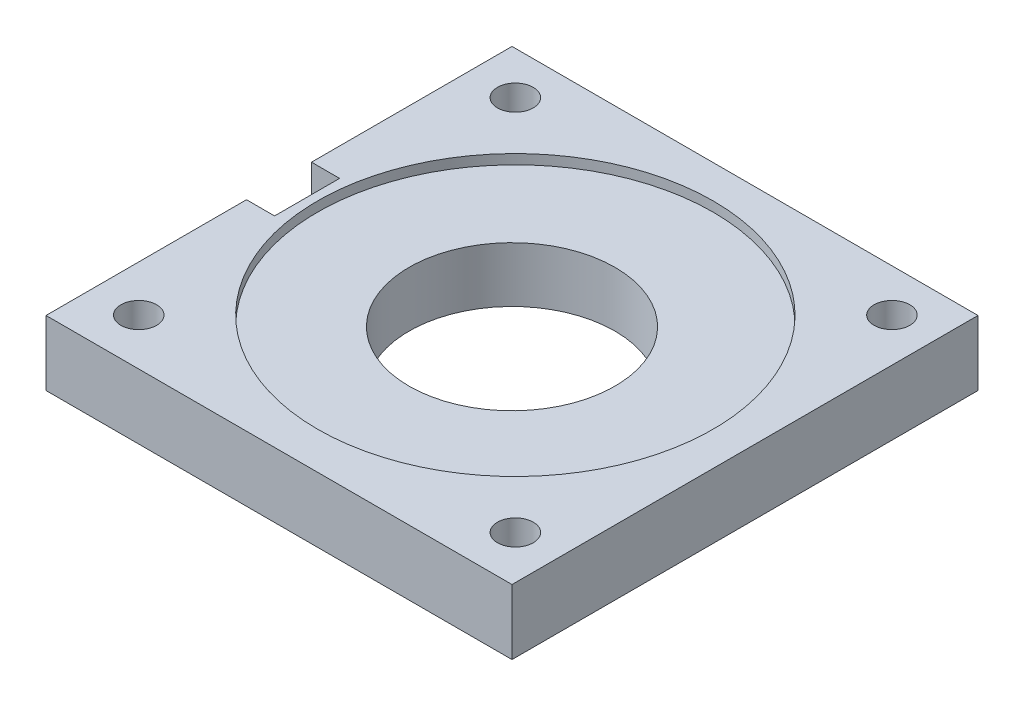
ISO-10303-21;
HEADER;
FILE_DESCRIPTION(('STEP AP214'),'2;1');
FILE_NAME('part.step','',(''),(''),'','','');
FILE_SCHEMA(('AUTOMOTIVE_DESIGN { 1 0 10303 214 1 1 1 1 }'));
ENDSEC;
DATA;
#1=APPLICATION_CONTEXT('core data for automotive mechanical design processes');
#2=APPLICATION_PROTOCOL_DEFINITION('international standard','automotive_design',2000,#1);
#3=PRODUCT_CONTEXT('',#1,'mechanical');
#4=PRODUCT('Part','Part','',(#3));
#5=PRODUCT_RELATED_PRODUCT_CATEGORY('part','',(#4));
#6=PRODUCT_DEFINITION_FORMATION('','',#4);
#7=PRODUCT_DEFINITION_CONTEXT('part definition',#1,'design');
#8=PRODUCT_DEFINITION('design','',#6,#7);
#9=PRODUCT_DEFINITION_SHAPE('','',#8);
#10=(LENGTH_UNIT() NAMED_UNIT(*) SI_UNIT(.MILLI.,.METRE.));
#11=(NAMED_UNIT(*) PLANE_ANGLE_UNIT() SI_UNIT($,.RADIAN.));
#12=(NAMED_UNIT(*) SI_UNIT($,.STERADIAN.) SOLID_ANGLE_UNIT());
#13=UNCERTAINTY_MEASURE_WITH_UNIT(LENGTH_MEASURE(1.E-05),#10,'distance_accuracy_value','');
#14=(GEOMETRIC_REPRESENTATION_CONTEXT(3) GLOBAL_UNCERTAINTY_ASSIGNED_CONTEXT((#13)) GLOBAL_UNIT_ASSIGNED_CONTEXT((#10,
#11,#12)) REPRESENTATION_CONTEXT('',''));
#15=CARTESIAN_POINT('',(0.,0.,0.));
#16=DIRECTION('',(0.,0.,1.));
#17=DIRECTION('',(1.,0.,0.));
#18=AXIS2_PLACEMENT_3D('',#15,#16,#17);
#19=CARTESIAN_POINT('',(-43.,12.,-43.));
#20=DIRECTION('',(1.,0.,0.));
#21=DIRECTION('',(0.,0.,-1.));
#22=AXIS2_PLACEMENT_3D('',#19,#20,#21);
#23=PLANE('',#22);
#24=DIRECTION('',(0.,0.,1.));
#25=VECTOR('',#24,1.);
#26=CARTESIAN_POINT('',(-43.,12.,-43.));
#27=LINE('',#26,#25);
#28=CARTESIAN_POINT('',(-43.,12.,6.00000000000001));
#29=VERTEX_POINT('',#28);
#30=CARTESIAN_POINT('',(-43.,12.,43.));
#31=VERTEX_POINT('',#30);
#32=EDGE_CURVE('E180',#29,#31,#27,.T.);
#33=ORIENTED_EDGE('',*,*,#32,.F.);
#34=DIRECTION('',(0.,-1.,0.));
#35=VECTOR('',#34,1.);
#36=CARTESIAN_POINT('',(-43.,12.,6.00000000000001));
#37=LINE('',#36,#35);
#38=CARTESIAN_POINT('',(-43.,0.,6.00000000000001));
#39=VERTEX_POINT('',#38);
#40=EDGE_CURVE('E11',#29,#39,#37,.T.);
#41=ORIENTED_EDGE('',*,*,#40,.T.);
#42=DIRECTION('',(0.,0.,1.));
#43=VECTOR('',#42,1.);
#44=CARTESIAN_POINT('',(-43.,0.,-43.));
#45=LINE('',#44,#43);
#46=CARTESIAN_POINT('',(-43.,0.,43.));
#47=VERTEX_POINT('',#46);
#48=EDGE_CURVE('E190',#39,#47,#45,.T.);
#49=ORIENTED_EDGE('',*,*,#48,.T.);
#50=DIRECTION('',(0.,-1.,0.));
#51=VECTOR('',#50,1.);
#52=CARTESIAN_POINT('',(-43.,12.,43.));
#53=LINE('',#52,#51);
#54=EDGE_CURVE('E195',#31,#47,#53,.T.);
#55=ORIENTED_EDGE('',*,*,#54,.F.);
#56=EDGE_LOOP('',(#33,#41,#49,#55));
#57=FACE_BOUND('',#56,.T.);
#58=ADVANCED_FACE('F37',(#57),#23,.F.);
#59=CARTESIAN_POINT('',(0.,12.,0.));
#60=DIRECTION('',(0.,-1.,0.));
#61=DIRECTION('',(0.,0.,-1.));
#62=AXIS2_PLACEMENT_3D('',#59,#60,#61);
#63=CYLINDRICAL_SURFACE('',#62,19.);
#64=CARTESIAN_POINT('',(0.,0.,0.));
#65=DIRECTION('',(0.,1.,0.));
#66=DIRECTION('',(0.,0.,1.));
#67=AXIS2_PLACEMENT_3D('',#64,#65,#66);
#68=CIRCLE('',#67,19.);
#69=CARTESIAN_POINT('',(0.,0.,19.));
#70=VERTEX_POINT('',#69);
#71=EDGE_CURVE('E173',#70,#70,#68,.T.);
#72=ORIENTED_EDGE('',*,*,#71,.F.);
#73=EDGE_LOOP('',(#72));
#74=FACE_BOUND('',#73,.T.);
#75=CARTESIAN_POINT('',(0.,10.2,0.));
#76=DIRECTION('',(0.,1.,0.));
#77=DIRECTION('',(0.,0.,1.));
#78=AXIS2_PLACEMENT_3D('',#75,#76,#77);
#79=CIRCLE('',#78,19.);
#80=CARTESIAN_POINT('',(0.,10.2,19.));
#81=VERTEX_POINT('',#80);
#82=EDGE_CURVE('E146',#81,#81,#79,.T.);
#83=ORIENTED_EDGE('',*,*,#82,.T.);
#84=EDGE_LOOP('',(#83));
#85=FACE_BOUND('',#84,.T.);
#86=ADVANCED_FACE('F232',(#74,#85),#63,.F.);
#87=CARTESIAN_POINT('',(0.,12.,0.));
#88=DIRECTION('',(0.,1.,0.));
#89=DIRECTION('',(0.,0.,1.));
#90=AXIS2_PLACEMENT_3D('',#87,#88,#89);
#91=PLANE('',#90);
#92=DIRECTION('',(1.,0.,0.));
#93=VECTOR('',#92,1.);
#94=CARTESIAN_POINT('',(-45.8870260509217,12.,6.00000000000001));
#95=LINE('',#94,#93);
#96=CARTESIAN_POINT('',(-37.816413021325,12.,6.00000000000001));
#97=VERTEX_POINT('',#96);
#98=EDGE_CURVE('E134',#29,#97,#95,.T.);
#99=ORIENTED_EDGE('',*,*,#98,.F.);
#100=ORIENTED_EDGE('',*,*,#32,.T.);
#101=DIRECTION('',(1.,0.,0.));
#102=VECTOR('',#101,1.);
#103=CARTESIAN_POINT('',(-43.,12.,43.));
#104=LINE('',#103,#102);
#105=CARTESIAN_POINT('',(43.,12.,43.));
#106=VERTEX_POINT('',#105);
#107=EDGE_CURVE('E61',#31,#106,#104,.T.);
#108=ORIENTED_EDGE('',*,*,#107,.T.);
#109=DIRECTION('',(0.,0.,-1.));
#110=VECTOR('',#109,1.);
#111=CARTESIAN_POINT('',(43.,12.,-43.));
#112=LINE('',#111,#110);
#113=CARTESIAN_POINT('',(43.,12.,-43.));
#114=VERTEX_POINT('',#113);
#115=EDGE_CURVE('E177',#106,#114,#112,.T.);
#116=ORIENTED_EDGE('',*,*,#115,.T.);
#117=DIRECTION('',(-1.,0.,0.));
#118=VECTOR('',#117,1.);
#119=CARTESIAN_POINT('',(-43.,12.,-43.));
#120=LINE('',#119,#118);
#121=CARTESIAN_POINT('',(-43.,12.,-43.));
#122=VERTEX_POINT('',#121);
#123=EDGE_CURVE('E90',#114,#122,#120,.T.);
#124=ORIENTED_EDGE('',*,*,#123,.T.);
#125=CARTESIAN_POINT('',(-43.,12.,-5.99999999999998));
#126=VERTEX_POINT('',#125);
#127=EDGE_CURVE('E181',#122,#126,#27,.T.);
#128=ORIENTED_EDGE('',*,*,#127,.T.);
#129=DIRECTION('',(-1.,0.,0.));
#130=VECTOR('',#129,1.);
#131=CARTESIAN_POINT('',(-45.8870260509217,12.,-5.99999999999999));
#132=LINE('',#131,#130);
#133=CARTESIAN_POINT('',(-37.816413021325,12.,-5.99999999999999));
#134=VERTEX_POINT('',#133);
#135=EDGE_CURVE('E52',#134,#126,#132,.T.);
#136=ORIENTED_EDGE('',*,*,#135,.F.);
#137=DIRECTION('',(0.,0.,-1.));
#138=VECTOR('',#137,1.);
#139=CARTESIAN_POINT('',(-37.816413021325,12.,-5.99999999999999));
#140=LINE('',#139,#138);
#141=EDGE_CURVE('E120',#97,#134,#140,.T.);
#142=ORIENTED_EDGE('',*,*,#141,.F.);
#143=EDGE_LOOP('',(#99,#100,#108,#116,#124,#128,#136,#142));
#144=FACE_BOUND('',#143,.T.);
#145=CARTESIAN_POINT('',(0.242410087433292,12.,-0.376719542038495));
#146=DIRECTION('',(0.,1.,0.));
#147=DIRECTION('',(0.,0.,1.));
#148=AXIS2_PLACEMENT_3D('',#145,#146,#147);
#149=CIRCLE('',#148,36.5);
#150=CARTESIAN_POINT('',(0.242410087433292,12.,36.1232804579615));
#151=VERTEX_POINT('',#150);
#152=EDGE_CURVE('E141',#151,#151,#149,.T.);
#153=ORIENTED_EDGE('',*,*,#152,.F.);
#154=EDGE_LOOP('',(#153));
#155=FACE_BOUND('',#154,.T.);
#156=CARTESIAN_POINT('',(-34.5075899125667,12.,-35.1267195420385));
#157=DIRECTION('',(0.,1.,0.));
#158=DIRECTION('',(0.,0.,1.));
#159=AXIS2_PLACEMENT_3D('',#156,#157,#158);
#160=CIRCLE('',#159,3.3);
#161=CARTESIAN_POINT('',(-34.5075899125667,12.,-31.8267195420385));
#162=VERTEX_POINT('',#161);
#163=EDGE_CURVE('E156',#162,#162,#160,.T.);
#164=ORIENTED_EDGE('',*,*,#163,.F.);
#165=EDGE_LOOP('',(#164));
#166=FACE_BOUND('',#165,.T.);
#167=CARTESIAN_POINT('',(34.9924100874333,12.,34.3732804579615));
#168=DIRECTION('',(0.,1.,0.));
#169=DIRECTION('',(0.,0.,1.));
#170=AXIS2_PLACEMENT_3D('',#167,#168,#169);
#171=CIRCLE('',#170,3.3);
#172=CARTESIAN_POINT('',(34.9924100874333,12.,37.6732804579615));
#173=VERTEX_POINT('',#172);
#174=EDGE_CURVE('E155',#173,#173,#171,.T.);
#175=ORIENTED_EDGE('',*,*,#174,.F.);
#176=EDGE_LOOP('',(#175));
#177=FACE_BOUND('',#176,.T.);
#178=CARTESIAN_POINT('',(34.9924100874333,12.,-35.1267195420385));
#179=DIRECTION('',(0.,1.,0.));
#180=DIRECTION('',(0.,0.,1.));
#181=AXIS2_PLACEMENT_3D('',#178,#179,#180);
#182=CIRCLE('',#181,3.3);
#183=CARTESIAN_POINT('',(34.9924100874333,12.,-31.8267195420385));
#184=VERTEX_POINT('',#183);
#185=EDGE_CURVE('E149',#184,#184,#182,.T.);
#186=ORIENTED_EDGE('',*,*,#185,.F.);
#187=EDGE_LOOP('',(#186));
#188=FACE_BOUND('',#187,.T.);
#189=CARTESIAN_POINT('',(-34.5075899125667,12.,34.3732804579615));
#190=DIRECTION('',(0.,1.,0.));
#191=DIRECTION('',(0.,0.,1.));
#192=AXIS2_PLACEMENT_3D('',#189,#190,#191);
#193=CIRCLE('',#192,3.3);
#194=CARTESIAN_POINT('',(-34.5075899125667,12.,37.6732804579615));
#195=VERTEX_POINT('',#194);
#196=EDGE_CURVE('E163',#195,#195,#193,.T.);
#197=ORIENTED_EDGE('',*,*,#196,.F.);
#198=EDGE_LOOP('',(#197));
#199=FACE_BOUND('',#198,.T.);
#200=ADVANCED_FACE('F207',(#144,#155,#166,#177,#188,#199),#91,.T.);
#201=CARTESIAN_POINT('',(0.,0.,0.));
#202=DIRECTION('',(0.,1.,0.));
#203=DIRECTION('',(0.,0.,1.));
#204=AXIS2_PLACEMENT_3D('',#201,#202,#203);
#205=PLANE('',#204);
#206=CARTESIAN_POINT('',(-34.5075899125667,0.,-35.1267195420385));
#207=DIRECTION('',(0.,1.,0.));
#208=DIRECTION('',(0.,0.,1.));
#209=AXIS2_PLACEMENT_3D('',#206,#207,#208);
#210=CIRCLE('',#209,3.3);
#211=CARTESIAN_POINT('',(-34.5075899125667,0.,-31.8267195420385));
#212=VERTEX_POINT('',#211);
#213=EDGE_CURVE('E159',#212,#212,#210,.F.);
#214=ORIENTED_EDGE('',*,*,#213,.F.);
#215=EDGE_LOOP('',(#214));
#216=FACE_BOUND('',#215,.T.);
#217=CARTESIAN_POINT('',(34.9924100874333,0.,34.3732804579615));
#218=DIRECTION('',(0.,1.,0.));
#219=DIRECTION('',(0.,0.,1.));
#220=AXIS2_PLACEMENT_3D('',#217,#218,#219);
#221=CIRCLE('',#220,3.3);
#222=CARTESIAN_POINT('',(34.9924100874333,0.,37.6732804579615));
#223=VERTEX_POINT('',#222);
#224=EDGE_CURVE('E160',#223,#223,#221,.F.);
#225=ORIENTED_EDGE('',*,*,#224,.F.);
#226=EDGE_LOOP('',(#225));
#227=FACE_BOUND('',#226,.T.);
#228=CARTESIAN_POINT('',(34.9924100874333,0.,-35.1267195420385));
#229=DIRECTION('',(0.,1.,0.));
#230=DIRECTION('',(0.,0.,1.));
#231=AXIS2_PLACEMENT_3D('',#228,#229,#230);
#232=CIRCLE('',#231,3.3);
#233=CARTESIAN_POINT('',(34.9924100874333,0.,-31.8267195420385));
#234=VERTEX_POINT('',#233);
#235=EDGE_CURVE('E152',#234,#234,#232,.F.);
#236=ORIENTED_EDGE('',*,*,#235,.F.);
#237=EDGE_LOOP('',(#236));
#238=FACE_BOUND('',#237,.T.);
#239=CARTESIAN_POINT('',(-34.5075899125667,0.,34.3732804579615));
#240=DIRECTION('',(0.,1.,0.));
#241=DIRECTION('',(0.,0.,1.));
#242=AXIS2_PLACEMENT_3D('',#239,#240,#241);
#243=CIRCLE('',#242,3.3);
#244=CARTESIAN_POINT('',(-34.5075899125667,0.,37.6732804579615));
#245=VERTEX_POINT('',#244);
#246=EDGE_CURVE('E170',#245,#245,#243,.F.);
#247=ORIENTED_EDGE('',*,*,#246,.F.);
#248=EDGE_LOOP('',(#247));
#249=FACE_BOUND('',#248,.T.);
#250=ORIENTED_EDGE('',*,*,#48,.F.);
#251=DIRECTION('',(1.,0.,0.));
#252=VECTOR('',#251,1.);
#253=CARTESIAN_POINT('',(-45.8870260509217,0.,6.00000000000001));
#254=LINE('',#253,#252);
#255=CARTESIAN_POINT('',(-37.816413021325,0.,6.00000000000001));
#256=VERTEX_POINT('',#255);
#257=EDGE_CURVE('E122',#39,#256,#254,.T.);
#258=ORIENTED_EDGE('',*,*,#257,.T.);
#259=DIRECTION('',(0.,0.,-1.));
#260=VECTOR('',#259,1.);
#261=CARTESIAN_POINT('',(-37.816413021325,0.,-5.99999999999999));
#262=LINE('',#261,#260);
#263=CARTESIAN_POINT('',(-37.816413021325,0.,-5.99999999999999));
#264=VERTEX_POINT('',#263);
#265=EDGE_CURVE('E117',#256,#264,#262,.T.);
#266=ORIENTED_EDGE('',*,*,#265,.T.);
#267=DIRECTION('',(-1.,0.,0.));
#268=VECTOR('',#267,1.);
#269=CARTESIAN_POINT('',(-45.8870260509217,0.,-5.99999999999999));
#270=LINE('',#269,#268);
#271=CARTESIAN_POINT('',(-43.,0.,-5.99999999999999));
#272=VERTEX_POINT('',#271);
#273=EDGE_CURVE('E125',#264,#272,#270,.T.);
#274=ORIENTED_EDGE('',*,*,#273,.T.);
#275=CARTESIAN_POINT('',(-43.,0.,-43.));
#276=VERTEX_POINT('',#275);
#277=EDGE_CURVE('E191',#276,#272,#45,.T.);
#278=ORIENTED_EDGE('',*,*,#277,.F.);
#279=DIRECTION('',(-1.,0.,0.));
#280=VECTOR('',#279,1.);
#281=CARTESIAN_POINT('',(-43.,0.,-43.));
#282=LINE('',#281,#280);
#283=CARTESIAN_POINT('',(43.,0.,-43.));
#284=VERTEX_POINT('',#283);
#285=EDGE_CURVE('E188',#284,#276,#282,.T.);
#286=ORIENTED_EDGE('',*,*,#285,.F.);
#287=DIRECTION('',(0.,0.,-1.));
#288=VECTOR('',#287,1.);
#289=CARTESIAN_POINT('',(43.,0.,-43.));
#290=LINE('',#289,#288);
#291=CARTESIAN_POINT('',(43.,0.,43.));
#292=VERTEX_POINT('',#291);
#293=EDGE_CURVE('E176',#292,#284,#290,.T.);
#294=ORIENTED_EDGE('',*,*,#293,.F.);
#295=DIRECTION('',(1.,0.,0.));
#296=VECTOR('',#295,1.);
#297=CARTESIAN_POINT('',(-43.,0.,43.));
#298=LINE('',#297,#296);
#299=EDGE_CURVE('E82',#47,#292,#298,.T.);
#300=ORIENTED_EDGE('',*,*,#299,.F.);
#301=EDGE_LOOP('',(#250,#258,#266,#274,#278,#286,#294,#300));
#302=FACE_BOUND('',#301,.T.);
#303=ORIENTED_EDGE('',*,*,#71,.T.);
#304=EDGE_LOOP('',(#303));
#305=FACE_BOUND('',#304,.T.);
#306=ADVANCED_FACE('F132',(#216,#227,#238,#249,#302,#305),#205,.F.);
#307=CARTESIAN_POINT('',(43.,12.,-43.));
#308=DIRECTION('',(-1.,0.,0.));
#309=DIRECTION('',(0.,0.,1.));
#310=AXIS2_PLACEMENT_3D('',#307,#308,#309);
#311=PLANE('',#310);
#312=ORIENTED_EDGE('',*,*,#293,.T.);
#313=DIRECTION('',(0.,-1.,0.));
#314=VECTOR('',#313,1.);
#315=CARTESIAN_POINT('',(43.,12.,-43.));
#316=LINE('',#315,#314);
#317=EDGE_CURVE('E200',#114,#284,#316,.T.);
#318=ORIENTED_EDGE('',*,*,#317,.F.);
#319=ORIENTED_EDGE('',*,*,#115,.F.);
#320=DIRECTION('',(0.,-1.,0.));
#321=VECTOR('',#320,1.);
#322=CARTESIAN_POINT('',(43.,12.,43.));
#323=LINE('',#322,#321);
#324=EDGE_CURVE('E185',#106,#292,#323,.T.);
#325=ORIENTED_EDGE('',*,*,#324,.T.);
#326=EDGE_LOOP('',(#312,#318,#319,#325));
#327=FACE_BOUND('',#326,.T.);
#328=ADVANCED_FACE('F39',(#327),#311,.F.);
#329=CARTESIAN_POINT('',(-43.,12.,-43.));
#330=DIRECTION('',(0.,0.,1.));
#331=DIRECTION('',(1.,0.,0.));
#332=AXIS2_PLACEMENT_3D('',#329,#330,#331);
#333=PLANE('',#332);
#334=ORIENTED_EDGE('',*,*,#285,.T.);
#335=DIRECTION('',(0.,-1.,0.));
#336=VECTOR('',#335,1.);
#337=CARTESIAN_POINT('',(-43.,12.,-43.));
#338=LINE('',#337,#336);
#339=EDGE_CURVE('E197',#122,#276,#338,.T.);
#340=ORIENTED_EDGE('',*,*,#339,.F.);
#341=ORIENTED_EDGE('',*,*,#123,.F.);
#342=ORIENTED_EDGE('',*,*,#317,.T.);
#343=EDGE_LOOP('',(#334,#340,#341,#342));
#344=FACE_BOUND('',#343,.T.);
#345=ADVANCED_FACE('F211',(#344),#333,.F.);
#346=ORIENTED_EDGE('',*,*,#277,.T.);
#347=DIRECTION('',(0.,1.,0.));
#348=VECTOR('',#347,1.);
#349=CARTESIAN_POINT('',(-43.,12.,-5.99999999999998));
#350=LINE('',#349,#348);
#351=EDGE_CURVE('E45',#272,#126,#350,.T.);
#352=ORIENTED_EDGE('',*,*,#351,.T.);
#353=ORIENTED_EDGE('',*,*,#127,.F.);
#354=ORIENTED_EDGE('',*,*,#339,.T.);
#355=EDGE_LOOP('',(#346,#352,#353,#354));
#356=FACE_BOUND('',#355,.T.);
#357=ADVANCED_FACE('F205',(#356),#23,.F.);
#358=CARTESIAN_POINT('',(-43.,12.,43.));
#359=DIRECTION('',(0.,0.,-1.));
#360=DIRECTION('',(-1.,0.,0.));
#361=AXIS2_PLACEMENT_3D('',#358,#359,#360);
#362=PLANE('',#361);
#363=ORIENTED_EDGE('',*,*,#299,.T.);
#364=ORIENTED_EDGE('',*,*,#324,.F.);
#365=ORIENTED_EDGE('',*,*,#107,.F.);
#366=ORIENTED_EDGE('',*,*,#54,.T.);
#367=EDGE_LOOP('',(#363,#364,#365,#366));
#368=FACE_BOUND('',#367,.T.);
#369=ADVANCED_FACE('F214',(#368),#362,.F.);
#370=CARTESIAN_POINT('',(-34.5075899125667,-0.000999999999999265,34.3732804579615));
#371=DIRECTION('',(0.,1.,0.));
#372=DIRECTION('',(0.,0.,1.));
#373=AXIS2_PLACEMENT_3D('',#370,#371,#372);
#374=CYLINDRICAL_SURFACE('',#373,3.3);
#375=ORIENTED_EDGE('',*,*,#196,.T.);
#376=EDGE_LOOP('',(#375));
#377=FACE_BOUND('',#376,.T.);
#378=ORIENTED_EDGE('',*,*,#246,.T.);
#379=EDGE_LOOP('',(#378));
#380=FACE_BOUND('',#379,.T.);
#381=ADVANCED_FACE('F245',(#377,#380),#374,.F.);
#382=CARTESIAN_POINT('',(34.9924100874333,-0.000999999999999265,-35.1267195420385));
#383=DIRECTION('',(0.,1.,0.));
#384=DIRECTION('',(0.,0.,1.));
#385=AXIS2_PLACEMENT_3D('',#382,#383,#384);
#386=CYLINDRICAL_SURFACE('',#385,3.3);
#387=ORIENTED_EDGE('',*,*,#185,.T.);
#388=EDGE_LOOP('',(#387));
#389=FACE_BOUND('',#388,.T.);
#390=ORIENTED_EDGE('',*,*,#235,.T.);
#391=EDGE_LOOP('',(#390));
#392=FACE_BOUND('',#391,.T.);
#393=ADVANCED_FACE('F263',(#389,#392),#386,.F.);
#394=CARTESIAN_POINT('',(34.9924100874333,-0.000999999999999265,34.3732804579615));
#395=DIRECTION('',(0.,1.,0.));
#396=DIRECTION('',(0.,0.,1.));
#397=AXIS2_PLACEMENT_3D('',#394,#395,#396);
#398=CYLINDRICAL_SURFACE('',#397,3.3);
#399=ORIENTED_EDGE('',*,*,#174,.T.);
#400=EDGE_LOOP('',(#399));
#401=FACE_BOUND('',#400,.T.);
#402=ORIENTED_EDGE('',*,*,#224,.T.);
#403=EDGE_LOOP('',(#402));
#404=FACE_BOUND('',#403,.T.);
#405=ADVANCED_FACE('F265',(#401,#404),#398,.F.);
#406=CARTESIAN_POINT('',(-34.5075899125667,-0.000999999999999265,-35.1267195420385));
#407=DIRECTION('',(0.,1.,0.));
#408=DIRECTION('',(0.,0.,1.));
#409=AXIS2_PLACEMENT_3D('',#406,#407,#408);
#410=CYLINDRICAL_SURFACE('',#409,3.3);
#411=ORIENTED_EDGE('',*,*,#163,.T.);
#412=EDGE_LOOP('',(#411));
#413=FACE_BOUND('',#412,.T.);
#414=ORIENTED_EDGE('',*,*,#213,.T.);
#415=EDGE_LOOP('',(#414));
#416=FACE_BOUND('',#415,.T.);
#417=ADVANCED_FACE('F268',(#413,#416),#410,.F.);
#418=CARTESIAN_POINT('',(0.242410087433292,10.2,-0.376719542038495));
#419=DIRECTION('',(0.,1.,0.));
#420=DIRECTION('',(0.,0.,1.));
#421=AXIS2_PLACEMENT_3D('',#418,#419,#420);
#422=CYLINDRICAL_SURFACE('',#421,36.5);
#423=CARTESIAN_POINT('',(0.242410087433292,10.2,-0.376719542038495));
#424=DIRECTION('',(0.,1.,0.));
#425=DIRECTION('',(0.,0.,1.));
#426=AXIS2_PLACEMENT_3D('',#423,#424,#425);
#427=CIRCLE('',#426,36.5);
#428=CARTESIAN_POINT('',(0.242410087433292,10.2,36.1232804579615));
#429=VERTEX_POINT('',#428);
#430=EDGE_CURVE('E143',#429,#429,#427,.T.);
#431=ORIENTED_EDGE('',*,*,#430,.F.);
#432=EDGE_LOOP('',(#431));
#433=FACE_BOUND('',#432,.T.);
#434=ORIENTED_EDGE('',*,*,#152,.T.);
#435=EDGE_LOOP('',(#434));
#436=FACE_BOUND('',#435,.T.);
#437=ADVANCED_FACE('F228',(#433,#436),#422,.F.);
#438=CARTESIAN_POINT('',(0.242410087433292,10.2,-0.376719542038495));
#439=DIRECTION('',(0.,1.,0.));
#440=DIRECTION('',(0.,0.,1.));
#441=AXIS2_PLACEMENT_3D('',#438,#439,#440);
#442=PLANE('',#441);
#443=ORIENTED_EDGE('',*,*,#82,.F.);
#444=EDGE_LOOP('',(#443));
#445=FACE_BOUND('',#444,.T.);
#446=ORIENTED_EDGE('',*,*,#430,.T.);
#447=EDGE_LOOP('',(#446));
#448=FACE_BOUND('',#447,.T.);
#449=ADVANCED_FACE('F221',(#445,#448),#442,.T.);
#450=CARTESIAN_POINT('',(-45.8870260509217,0.,6.00000000000001));
#451=DIRECTION('',(0.,0.,1.));
#452=DIRECTION('',(1.,0.,0.));
#453=AXIS2_PLACEMENT_3D('',#450,#451,#452);
#454=PLANE('',#453);
#455=ORIENTED_EDGE('',*,*,#98,.T.);
#456=DIRECTION('',(0.,1.,0.));
#457=VECTOR('',#456,1.);
#458=CARTESIAN_POINT('',(-37.816413021325,0.,6.00000000000001));
#459=LINE('',#458,#457);
#460=EDGE_CURVE('E121',#256,#97,#459,.T.);
#461=ORIENTED_EDGE('',*,*,#460,.F.);
#462=ORIENTED_EDGE('',*,*,#257,.F.);
#463=ORIENTED_EDGE('',*,*,#40,.F.);
#464=EDGE_LOOP('',(#455,#461,#462,#463));
#465=FACE_BOUND('',#464,.T.);
#466=ADVANCED_FACE('F219',(#465),#454,.F.);
#467=CARTESIAN_POINT('',(-45.8870260509217,0.,-5.99999999999999));
#468=DIRECTION('',(0.,0.,-1.));
#469=DIRECTION('',(-1.,0.,0.));
#470=AXIS2_PLACEMENT_3D('',#467,#468,#469);
#471=PLANE('',#470);
#472=ORIENTED_EDGE('',*,*,#273,.F.);
#473=DIRECTION('',(0.,1.,0.));
#474=VECTOR('',#473,1.);
#475=CARTESIAN_POINT('',(-37.816413021325,0.,-5.99999999999999));
#476=LINE('',#475,#474);
#477=EDGE_CURVE('E112',#264,#134,#476,.T.);
#478=ORIENTED_EDGE('',*,*,#477,.T.);
#479=ORIENTED_EDGE('',*,*,#135,.T.);
#480=ORIENTED_EDGE('',*,*,#351,.F.);
#481=EDGE_LOOP('',(#472,#478,#479,#480));
#482=FACE_BOUND('',#481,.T.);
#483=ADVANCED_FACE('F126',(#482),#471,.F.);
#484=CARTESIAN_POINT('',(-37.816413021325,0.,-5.99999999999999));
#485=DIRECTION('',(1.,0.,0.));
#486=DIRECTION('',(0.,0.,-1.));
#487=AXIS2_PLACEMENT_3D('',#484,#485,#486);
#488=PLANE('',#487);
#489=ORIENTED_EDGE('',*,*,#141,.T.);
#490=ORIENTED_EDGE('',*,*,#477,.F.);
#491=ORIENTED_EDGE('',*,*,#265,.F.);
#492=ORIENTED_EDGE('',*,*,#460,.T.);
#493=EDGE_LOOP('',(#489,#490,#491,#492));
#494=FACE_BOUND('',#493,.T.);
#495=ADVANCED_FACE('F114',(#494),#488,.F.);
#496=CLOSED_SHELL('',(#58,#86,#200,#306,#328,#345,#357,#369,#381,#393,#405,#417,#437,#449,#466,
#483,#495));
#497=MANIFOLD_SOLID_BREP('B2',#496);
#498=ADVANCED_BREP_SHAPE_REPRESENTATION('',(#18,#497),#14);
#499=SHAPE_DEFINITION_REPRESENTATION(#9,#498);
ENDSEC;
END-ISO-10303-21;
